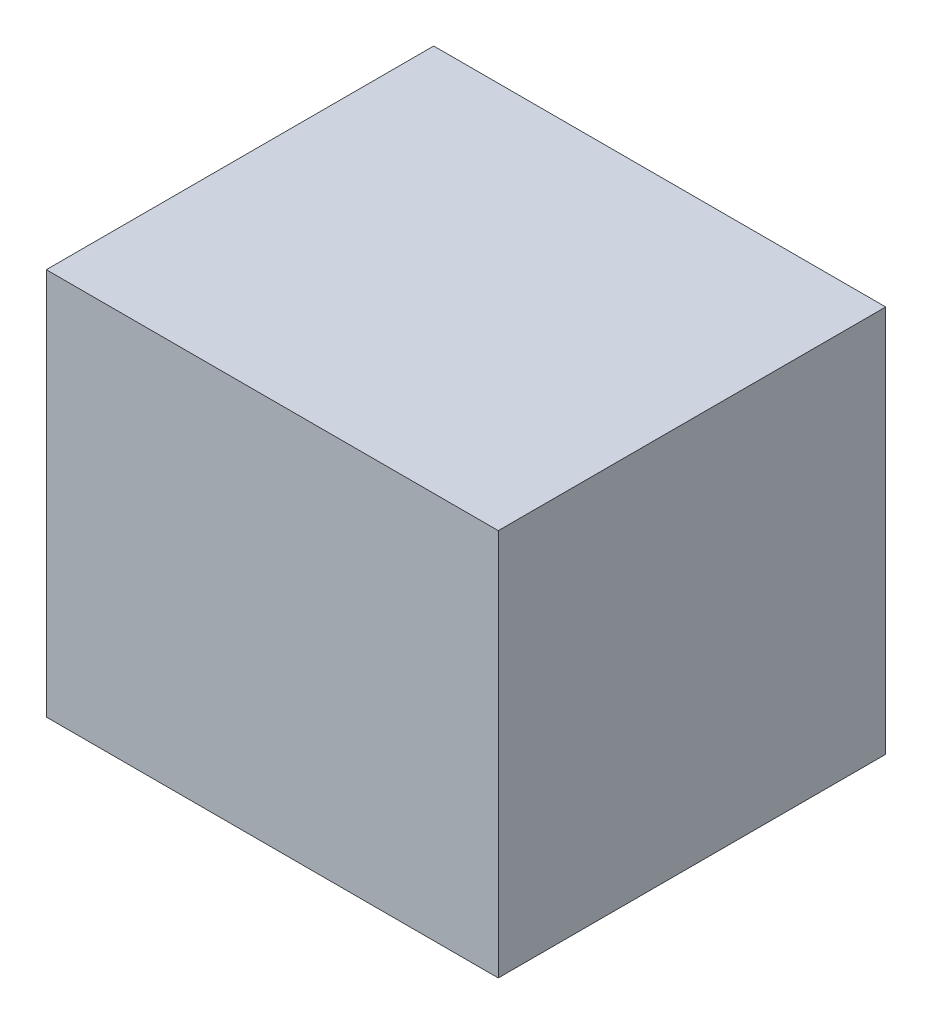
ISO-10303-21;
HEADER;
FILE_DESCRIPTION(('STEP AP214'),'2;1');
FILE_NAME('part.step','',(''),(''),'','','');
FILE_SCHEMA(('AUTOMOTIVE_DESIGN { 1 0 10303 214 1 1 1 1 }'));
ENDSEC;
DATA;
#1=APPLICATION_CONTEXT('core data for automotive mechanical design processes');
#2=APPLICATION_PROTOCOL_DEFINITION('international standard','automotive_design',2000,#1);
#3=PRODUCT_CONTEXT('',#1,'mechanical');
#4=PRODUCT('Part','Part','',(#3));
#5=PRODUCT_RELATED_PRODUCT_CATEGORY('part','',(#4));
#6=PRODUCT_DEFINITION_FORMATION('','',#4);
#7=PRODUCT_DEFINITION_CONTEXT('part definition',#1,'design');
#8=PRODUCT_DEFINITION('design','',#6,#7);
#9=PRODUCT_DEFINITION_SHAPE('','',#8);
#10=(LENGTH_UNIT() NAMED_UNIT(*) SI_UNIT(.MILLI.,.METRE.));
#11=(NAMED_UNIT(*) PLANE_ANGLE_UNIT() SI_UNIT($,.RADIAN.));
#12=(NAMED_UNIT(*) SI_UNIT($,.STERADIAN.) SOLID_ANGLE_UNIT());
#13=UNCERTAINTY_MEASURE_WITH_UNIT(LENGTH_MEASURE(1.E-05),#10,'distance_accuracy_value','');
#14=(GEOMETRIC_REPRESENTATION_CONTEXT(3) GLOBAL_UNCERTAINTY_ASSIGNED_CONTEXT((#13)) GLOBAL_UNIT_ASSIGNED_CONTEXT((#10,
#11,#12)) REPRESENTATION_CONTEXT('',''));
#15=CARTESIAN_POINT('',(0.,0.,0.));
#16=DIRECTION('',(0.,0.,1.));
#17=DIRECTION('',(1.,0.,0.));
#18=AXIS2_PLACEMENT_3D('',#15,#16,#17);
#19=CARTESIAN_POINT('',(88.9,38.1,38.1));
#20=DIRECTION('',(0.,0.,-1.));
#21=DIRECTION('',(-1.,0.,0.));
#22=AXIS2_PLACEMENT_3D('',#19,#20,#21);
#23=PLANE('',#22);
#24=DIRECTION('',(0.,-1.,0.));
#25=VECTOR('',#24,1.);
#26=CARTESIAN_POINT('',(0.,38.1,38.1));
#27=LINE('',#26,#25);
#28=CARTESIAN_POINT('',(0.,38.1,38.1));
#29=VERTEX_POINT('',#28);
#30=CARTESIAN_POINT('',(0.,-38.1,38.1));
#31=VERTEX_POINT('',#30);
#32=EDGE_CURVE('E102',#29,#31,#27,.T.);
#33=ORIENTED_EDGE('',*,*,#32,.T.);
#34=DIRECTION('',(-1.,0.,0.));
#35=VECTOR('',#34,1.);
#36=CARTESIAN_POINT('',(88.9,-38.1,38.1));
#37=LINE('',#36,#35);
#38=CARTESIAN_POINT('',(88.9,-38.1,38.1));
#39=VERTEX_POINT('',#38);
#40=EDGE_CURVE('E11',#39,#31,#37,.T.);
#41=ORIENTED_EDGE('',*,*,#40,.F.);
#42=DIRECTION('',(0.,-1.,0.));
#43=VECTOR('',#42,1.);
#44=CARTESIAN_POINT('',(88.9,38.1,38.1));
#45=LINE('',#44,#43);
#46=CARTESIAN_POINT('',(88.9,38.1,38.1));
#47=VERTEX_POINT('',#46);
#48=EDGE_CURVE('E90',#47,#39,#45,.T.);
#49=ORIENTED_EDGE('',*,*,#48,.F.);
#50=DIRECTION('',(-1.,0.,0.));
#51=VECTOR('',#50,1.);
#52=CARTESIAN_POINT('',(88.9,38.1,38.1));
#53=LINE('',#52,#51);
#54=EDGE_CURVE('E98',#47,#29,#53,.T.);
#55=ORIENTED_EDGE('',*,*,#54,.T.);
#56=EDGE_LOOP('',(#33,#41,#49,#55));
#57=FACE_BOUND('',#56,.T.);
#58=ADVANCED_FACE('F39',(#57),#23,.F.);
#59=CARTESIAN_POINT('',(88.9,-38.1,-38.1));
#60=DIRECTION('',(0.,1.,0.));
#61=DIRECTION('',(0.,0.,1.));
#62=AXIS2_PLACEMENT_3D('',#59,#60,#61);
#63=PLANE('',#62);
#64=DIRECTION('',(0.,0.,-1.));
#65=VECTOR('',#64,1.);
#66=CARTESIAN_POINT('',(0.,-38.1,-38.1));
#67=LINE('',#66,#65);
#68=CARTESIAN_POINT('',(0.,-38.1,-38.1));
#69=VERTEX_POINT('',#68);
#70=EDGE_CURVE('E94',#31,#69,#67,.T.);
#71=ORIENTED_EDGE('',*,*,#70,.T.);
#72=DIRECTION('',(-1.,0.,0.));
#73=VECTOR('',#72,1.);
#74=CARTESIAN_POINT('',(88.9,-38.1,-38.1));
#75=LINE('',#74,#73);
#76=CARTESIAN_POINT('',(88.9,-38.1,-38.1));
#77=VERTEX_POINT('',#76);
#78=EDGE_CURVE('E47',#77,#69,#75,.T.);
#79=ORIENTED_EDGE('',*,*,#78,.F.);
#80=DIRECTION('',(0.,0.,-1.));
#81=VECTOR('',#80,1.);
#82=CARTESIAN_POINT('',(88.9,-38.1,-38.1));
#83=LINE('',#82,#81);
#84=EDGE_CURVE('E85',#39,#77,#83,.T.);
#85=ORIENTED_EDGE('',*,*,#84,.F.);
#86=ORIENTED_EDGE('',*,*,#40,.T.);
#87=EDGE_LOOP('',(#71,#79,#85,#86));
#88=FACE_BOUND('',#87,.T.);
#89=ADVANCED_FACE('F93',(#88),#63,.F.);
#90=CARTESIAN_POINT('',(88.9,38.1,-38.1));
#91=DIRECTION('',(0.,0.,1.));
#92=DIRECTION('',(0.,-1.,0.));
#93=AXIS2_PLACEMENT_3D('',#90,#91,#92);
#94=PLANE('',#93);
#95=DIRECTION('',(0.,1.,0.));
#96=VECTOR('',#95,1.);
#97=CARTESIAN_POINT('',(0.,38.1,-38.1));
#98=LINE('',#97,#96);
#99=CARTESIAN_POINT('',(0.,38.1,-38.1));
#100=VERTEX_POINT('',#99);
#101=EDGE_CURVE('E72',#69,#100,#98,.T.);
#102=ORIENTED_EDGE('',*,*,#101,.T.);
#103=DIRECTION('',(-1.,0.,0.));
#104=VECTOR('',#103,1.);
#105=CARTESIAN_POINT('',(88.9,38.1,-38.1));
#106=LINE('',#105,#104);
#107=CARTESIAN_POINT('',(88.9,38.1,-38.1));
#108=VERTEX_POINT('',#107);
#109=EDGE_CURVE('E95',#108,#100,#106,.T.);
#110=ORIENTED_EDGE('',*,*,#109,.F.);
#111=DIRECTION('',(0.,1.,0.));
#112=VECTOR('',#111,1.);
#113=CARTESIAN_POINT('',(88.9,38.1,-38.1));
#114=LINE('',#113,#112);
#115=EDGE_CURVE('E88',#77,#108,#114,.T.);
#116=ORIENTED_EDGE('',*,*,#115,.F.);
#117=ORIENTED_EDGE('',*,*,#78,.T.);
#118=EDGE_LOOP('',(#102,#110,#116,#117));
#119=FACE_BOUND('',#118,.T.);
#120=ADVANCED_FACE('F96',(#119),#94,.F.);
#121=CARTESIAN_POINT('',(88.9,38.1,-38.1));
#122=DIRECTION('',(0.,-1.,0.));
#123=DIRECTION('',(0.,0.,-1.));
#124=AXIS2_PLACEMENT_3D('',#121,#122,#123);
#125=PLANE('',#124);
#126=DIRECTION('',(0.,0.,1.));
#127=VECTOR('',#126,1.);
#128=CARTESIAN_POINT('',(0.,38.1,-38.1));
#129=LINE('',#128,#127);
#130=EDGE_CURVE('E78',#100,#29,#129,.T.);
#131=ORIENTED_EDGE('',*,*,#130,.T.);
#132=ORIENTED_EDGE('',*,*,#54,.F.);
#133=DIRECTION('',(0.,0.,1.));
#134=VECTOR('',#133,1.);
#135=CARTESIAN_POINT('',(88.9,38.1,-38.1));
#136=LINE('',#135,#134);
#137=EDGE_CURVE('E55',#108,#47,#136,.T.);
#138=ORIENTED_EDGE('',*,*,#137,.F.);
#139=ORIENTED_EDGE('',*,*,#109,.T.);
#140=EDGE_LOOP('',(#131,#132,#138,#139));
#141=FACE_BOUND('',#140,.T.);
#142=ADVANCED_FACE('F109',(#141),#125,.F.);
#143=CARTESIAN_POINT('',(88.9,0.,0.));
#144=DIRECTION('',(-1.,0.,0.));
#145=DIRECTION('',(0.,0.,1.));
#146=AXIS2_PLACEMENT_3D('',#143,#144,#145);
#147=PLANE('',#146);
#148=ORIENTED_EDGE('',*,*,#48,.T.);
#149=ORIENTED_EDGE('',*,*,#84,.T.);
#150=ORIENTED_EDGE('',*,*,#115,.T.);
#151=ORIENTED_EDGE('',*,*,#137,.T.);
#152=EDGE_LOOP('',(#148,#149,#150,#151));
#153=FACE_BOUND('',#152,.T.);
#154=ADVANCED_FACE('F86',(#153),#147,.F.);
#155=CARTESIAN_POINT('',(0.,0.,0.));
#156=DIRECTION('',(-1.,0.,0.));
#157=DIRECTION('',(0.,0.,1.));
#158=AXIS2_PLACEMENT_3D('',#155,#156,#157);
#159=PLANE('',#158);
#160=ORIENTED_EDGE('',*,*,#32,.F.);
#161=ORIENTED_EDGE('',*,*,#130,.F.);
#162=ORIENTED_EDGE('',*,*,#101,.F.);
#163=ORIENTED_EDGE('',*,*,#70,.F.);
#164=EDGE_LOOP('',(#160,#161,#162,#163));
#165=FACE_BOUND('',#164,.T.);
#166=ADVANCED_FACE('F112',(#165),#159,.T.);
#167=CLOSED_SHELL('',(#58,#89,#120,#142,#154,#166));
#168=MANIFOLD_SOLID_BREP('B2',#167);
#169=ADVANCED_BREP_SHAPE_REPRESENTATION('',(#18,#168),#14);
#170=SHAPE_DEFINITION_REPRESENTATION(#9,#169);
ENDSEC;
END-ISO-10303-21;
